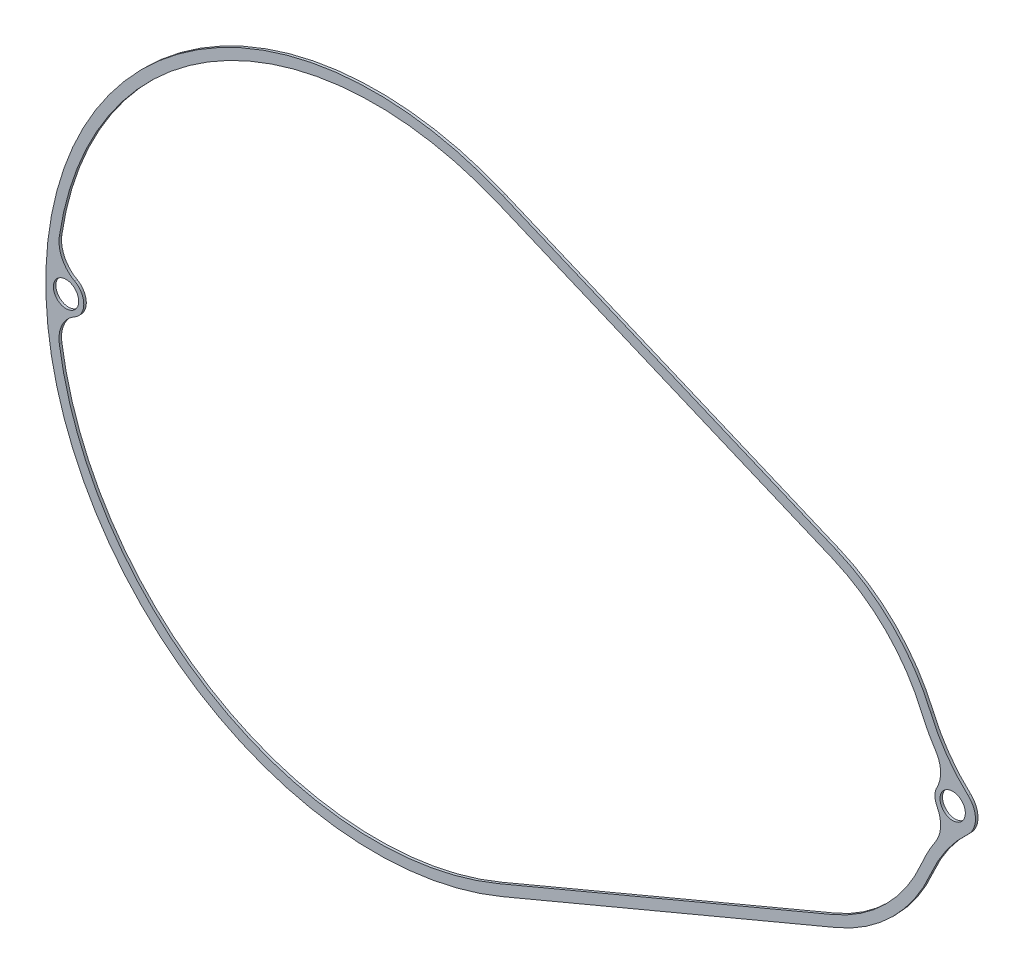
ISO-10303-21;
HEADER;
FILE_DESCRIPTION(('STEP AP214'),'2;1');
FILE_NAME('part.step','',(''),(''),'','','');
FILE_SCHEMA(('AUTOMOTIVE_DESIGN { 1 0 10303 214 1 1 1 1 }'));
ENDSEC;
DATA;
#1=APPLICATION_CONTEXT('core data for automotive mechanical design processes');
#2=APPLICATION_PROTOCOL_DEFINITION('international standard','automotive_design',2000,#1);
#3=PRODUCT_CONTEXT('',#1,'mechanical');
#4=PRODUCT('Part','Part','',(#3));
#5=PRODUCT_RELATED_PRODUCT_CATEGORY('part','',(#4));
#6=PRODUCT_DEFINITION_FORMATION('','',#4);
#7=PRODUCT_DEFINITION_CONTEXT('part definition',#1,'design');
#8=PRODUCT_DEFINITION('design','',#6,#7);
#9=PRODUCT_DEFINITION_SHAPE('','',#8);
#10=(LENGTH_UNIT() NAMED_UNIT(*) SI_UNIT(.MILLI.,.METRE.));
#11=(NAMED_UNIT(*) PLANE_ANGLE_UNIT() SI_UNIT($,.RADIAN.));
#12=(NAMED_UNIT(*) SI_UNIT($,.STERADIAN.) SOLID_ANGLE_UNIT());
#13=UNCERTAINTY_MEASURE_WITH_UNIT(LENGTH_MEASURE(1.E-05),#10,'distance_accuracy_value','');
#14=(GEOMETRIC_REPRESENTATION_CONTEXT(3) GLOBAL_UNCERTAINTY_ASSIGNED_CONTEXT((#13)) GLOBAL_UNIT_ASSIGNED_CONTEXT((#10,
#11,#12)) REPRESENTATION_CONTEXT('',''));
#15=CARTESIAN_POINT('',(0.,0.,0.));
#16=DIRECTION('',(0.,0.,1.));
#17=DIRECTION('',(1.,0.,0.));
#18=AXIS2_PLACEMENT_3D('',#15,#16,#17);
#19=CARTESIAN_POINT('',(-250.52892790721,0.,0.5));
#20=DIRECTION('',(0.,0.,-1.));
#21=DIRECTION('',(-1.,0.,0.));
#22=AXIS2_PLACEMENT_3D('',#19,#20,#21);
#23=CYLINDRICAL_SURFACE('',#22,63.);
#24=CARTESIAN_POINT('',(-250.52892790721,0.,0.5));
#25=DIRECTION('',(0.,0.,1.));
#26=DIRECTION('',(1.,0.,0.));
#27=AXIS2_PLACEMENT_3D('',#24,#25,#26);
#28=CIRCLE('',#27,63.);
#29=CARTESIAN_POINT('',(-226.141831133016,58.088462803952,0.5));
#30=VERTEX_POINT('',#29);
#31=CARTESIAN_POINT('',(-312.856257501688,9.18172018857619,0.5));
#32=VERTEX_POINT('',#31);
#33=EDGE_CURVE('E190',#30,#32,#28,.T.);
#34=ORIENTED_EDGE('',*,*,#33,.T.);
#35=DIRECTION('',(0.,0.,-1.));
#36=VECTOR('',#35,1.);
#37=CARTESIAN_POINT('',(-312.856257501688,9.18172018857619,0.5));
#38=LINE('',#37,#36);
#39=CARTESIAN_POINT('',(-312.856257501688,9.18172018857619,0.));
#40=VERTEX_POINT('',#39);
#41=EDGE_CURVE('E303',#32,#40,#38,.T.);
#42=ORIENTED_EDGE('',*,*,#41,.T.);
#43=CARTESIAN_POINT('',(-250.52892790721,0.,0.));
#44=DIRECTION('',(0.,0.,1.));
#45=DIRECTION('',(1.,0.,0.));
#46=AXIS2_PLACEMENT_3D('',#43,#44,#45);
#47=CIRCLE('',#46,63.);
#48=CARTESIAN_POINT('',(-226.141831133016,58.088462803952,0.));
#49=VERTEX_POINT('',#48);
#50=EDGE_CURVE('E213',#49,#40,#47,.T.);
#51=ORIENTED_EDGE('',*,*,#50,.F.);
#52=DIRECTION('',(0.,0.,-1.));
#53=VECTOR('',#52,1.);
#54=CARTESIAN_POINT('',(-226.141831133016,58.088462803952,0.5));
#55=LINE('',#54,#53);
#56=EDGE_CURVE('E183',#30,#49,#55,.T.);
#57=ORIENTED_EDGE('',*,*,#56,.F.);
#58=EDGE_LOOP('',(#34,#42,#51,#57));
#59=FACE_BOUND('',#58,.T.);
#60=ADVANCED_FACE('F16',(#59),#23,.F.);
#61=CARTESIAN_POINT('',(-113.207010098991,-25.423181345903,0.5));
#62=DIRECTION('',(0.,0.,1.));
#63=DIRECTION('',(1.,0.,0.));
#64=AXIS2_PLACEMENT_3D('',#61,#62,#63);
#65=PLANE('',#64);
#66=CARTESIAN_POINT('',(-311.52892790721,0.,0.5));
#67=DIRECTION('',(0.,0.,-1.));
#68=DIRECTION('',(-1.,0.,0.));
#69=AXIS2_PLACEMENT_3D('',#66,#67,#68);
#70=CIRCLE('',#69,2.5);
#71=CARTESIAN_POINT('',(-314.02892790721,0.,0.5));
#72=VERTEX_POINT('',#71);
#73=EDGE_CURVE('E372',#72,#72,#70,.T.);
#74=ORIENTED_EDGE('',*,*,#73,.T.);
#75=EDGE_LOOP('',(#74));
#76=FACE_BOUND('',#75,.T.);
#77=CARTESIAN_POINT('',(-312.856257501688,-9.18172018857617,0.5));
#78=VERTEX_POINT('',#77);
#79=CARTESIAN_POINT('',(-226.141831133016,-58.088462803952,0.5));
#80=VERTEX_POINT('',#79);
#81=EDGE_CURVE('E191',#78,#80,#28,.T.);
#82=ORIENTED_EDGE('',*,*,#81,.F.);
#83=CARTESIAN_POINT('',(-306.920321349833,-8.30727064680702,0.5));
#84=DIRECTION('',(0.,0.,1.));
#85=DIRECTION('',(1.,0.,0.));
#86=AXIS2_PLACEMENT_3D('',#83,#84,#85);
#87=CIRCLE('',#86,6.);
#88=CARTESIAN_POINT('',(-309.831020228176,-3.06057339619207,0.5));
#89=VERTEX_POINT('',#88);
#90=EDGE_CURVE('E316',#78,#89,#87,.F.);
#91=ORIENTED_EDGE('',*,*,#90,.T.);
#92=CARTESIAN_POINT('',(-311.52892790721,0.,0.5));
#93=DIRECTION('',(0.,0.,1.));
#94=DIRECTION('',(1.,0.,0.));
#95=AXIS2_PLACEMENT_3D('',#92,#93,#94);
#96=CIRCLE('',#95,3.5);
#97=CARTESIAN_POINT('',(-309.831020228176,3.06057339619208,0.5));
#98=VERTEX_POINT('',#97);
#99=EDGE_CURVE('E365',#89,#98,#96,.T.);
#100=ORIENTED_EDGE('',*,*,#99,.T.);
#101=CARTESIAN_POINT('',(-306.920321349833,8.30727064680703,0.5));
#102=DIRECTION('',(0.,0.,1.));
#103=DIRECTION('',(1.,0.,0.));
#104=AXIS2_PLACEMENT_3D('',#101,#102,#103);
#105=CIRCLE('',#104,6.);
#106=EDGE_CURVE('E318',#98,#32,#105,.F.);
#107=ORIENTED_EDGE('',*,*,#106,.T.);
#108=ORIENTED_EDGE('',*,*,#33,.F.);
#109=DIRECTION('',(-0.922039092126222,0.38709677419355,0.));
#110=VECTOR('',#109,1.);
#111=CARTESIAN_POINT('',(-160.254734358823,30.4272900401653,0.5));
#112=LINE('',#111,#110);
#113=CARTESIAN_POINT('',(-160.254734358823,30.4272900401653,0.5));
#114=VERTEX_POINT('',#113);
#115=EDGE_CURVE('E174',#114,#30,#112,.T.);
#116=ORIENTED_EDGE('',*,*,#115,.F.);
#117=CARTESIAN_POINT('',(-173.02892790721,0.,0.5));
#118=DIRECTION('',(0.,0.,1.));
#119=DIRECTION('',(1.,0.,0.));
#120=AXIS2_PLACEMENT_3D('',#117,#118,#119);
#121=CIRCLE('',#120,33.);
#122=CARTESIAN_POINT('',(-142.657800404576,12.9071536063815,0.5));
#123=VERTEX_POINT('',#122);
#124=EDGE_CURVE('E164',#123,#114,#121,.T.);
#125=ORIENTED_EDGE('',*,*,#124,.F.);
#126=CARTESIAN_POINT('',(-113.207010098991,25.423181345903,0.5));
#127=DIRECTION('',(0.,0.,-1.));
#128=DIRECTION('',(1.,0.,0.));
#129=AXIS2_PLACEMENT_3D('',#126,#127,#128);
#130=CIRCLE('',#129,32.);
#131=CARTESIAN_POINT('',(-139.904323330411,7.78080434552561,0.5));
#132=VERTEX_POINT('',#131);
#133=EDGE_CURVE('E206',#132,#123,#130,.T.);
#134=ORIENTED_EDGE('',*,*,#133,.F.);
#135=CARTESIAN_POINT('',(-144.910069561303,4.47285865795486,0.5));
#136=DIRECTION('',(0.,0.,1.));
#137=DIRECTION('',(1.,0.,0.));
#138=AXIS2_PLACEMENT_3D('',#135,#136,#137);
#139=CIRCLE('',#138,6.);
#140=CARTESIAN_POINT('',(-139.616716937665,1.64789529503601,0.5));
#141=VERTEX_POINT('',#140);
#142=EDGE_CURVE('E11',#132,#141,#139,.F.);
#143=ORIENTED_EDGE('',*,*,#142,.T.);
#144=CARTESIAN_POINT('',(-136.52892790721,0.,0.5));
#145=DIRECTION('',(0.,0.,1.));
#146=DIRECTION('',(1.,0.,0.));
#147=AXIS2_PLACEMENT_3D('',#144,#145,#146);
#148=CIRCLE('',#147,3.5);
#149=CARTESIAN_POINT('',(-139.616716937665,-1.64789529503601,0.5));
#150=VERTEX_POINT('',#149);
#151=EDGE_CURVE('E338',#141,#150,#148,.T.);
#152=ORIENTED_EDGE('',*,*,#151,.T.);
#153=CARTESIAN_POINT('',(-144.910069561303,-4.47285865795487,0.5));
#154=DIRECTION('',(0.,0.,1.));
#155=DIRECTION('',(1.,0.,0.));
#156=AXIS2_PLACEMENT_3D('',#153,#154,#155);
#157=CIRCLE('',#156,6.);
#158=CARTESIAN_POINT('',(-139.904323330411,-7.78080434552562,0.5));
#159=VERTEX_POINT('',#158);
#160=EDGE_CURVE('E322',#150,#159,#157,.F.);
#161=ORIENTED_EDGE('',*,*,#160,.T.);
#162=CARTESIAN_POINT('',(-113.207010098991,-25.423181345903,0.5));
#163=DIRECTION('',(0.,0.,-1.));
#164=DIRECTION('',(1.,0.,0.));
#165=AXIS2_PLACEMENT_3D('',#162,#163,#164);
#166=CIRCLE('',#165,32.);
#167=CARTESIAN_POINT('',(-142.657800404576,-12.9071536063815,0.5));
#168=VERTEX_POINT('',#167);
#169=EDGE_CURVE('E200',#168,#159,#166,.T.);
#170=ORIENTED_EDGE('',*,*,#169,.F.);
#171=CARTESIAN_POINT('',(-173.02892790721,0.,0.5));
#172=DIRECTION('',(0.,0.,1.));
#173=DIRECTION('',(1.,0.,0.));
#174=AXIS2_PLACEMENT_3D('',#171,#172,#173);
#175=CIRCLE('',#174,33.);
#176=CARTESIAN_POINT('',(-160.254734358823,-30.4272900401653,0.5));
#177=VERTEX_POINT('',#176);
#178=EDGE_CURVE('E198',#177,#168,#175,.T.);
#179=ORIENTED_EDGE('',*,*,#178,.F.);
#180=DIRECTION('',(0.922039092126222,0.38709677419355,0.));
#181=VECTOR('',#180,1.);
#182=CARTESIAN_POINT('',(-226.141831133016,-58.088462803952,0.5));
#183=LINE('',#182,#181);
#184=EDGE_CURVE('E196',#80,#177,#183,.T.);
#185=ORIENTED_EDGE('',*,*,#184,.F.);
#186=EDGE_LOOP('',(#82,#91,#100,#107,#108,#116,#125,#134,#143,#152,#161,#170,#179,#185));
#187=FACE_BOUND('',#186,.T.);
#188=CARTESIAN_POINT('',(-113.207010098991,-25.423181345903,0.5));
#189=DIRECTION('',(0.,0.,-1.));
#190=DIRECTION('',(1.,0.,0.));
#191=AXIS2_PLACEMENT_3D('',#188,#189,#190);
#192=CIRCLE('',#191,30.);
#193=CARTESIAN_POINT('',(-140.817126010477,-13.6894053401016,0.5));
#194=VERTEX_POINT('',#193);
#195=CARTESIAN_POINT('',(-133.486938627878,-3.31606713207429,0.5));
#196=VERTEX_POINT('',#195);
#197=EDGE_CURVE('E238',#194,#196,#192,.T.);
#198=ORIENTED_EDGE('',*,*,#197,.T.);
#199=CARTESIAN_POINT('',(-136.52892790721,0.,0.5));
#200=DIRECTION('',(0.,0.,1.));
#201=DIRECTION('',(1.,0.,0.));
#202=AXIS2_PLACEMENT_3D('',#199,#200,#201);
#203=CIRCLE('',#202,4.5);
#204=CARTESIAN_POINT('',(-133.486938627878,3.31606713207429,0.5));
#205=VERTEX_POINT('',#204);
#206=EDGE_CURVE('E241',#196,#205,#203,.T.);
#207=ORIENTED_EDGE('',*,*,#206,.T.);
#208=CARTESIAN_POINT('',(-113.207010098991,25.423181345903,0.5));
#209=DIRECTION('',(0.,0.,-1.));
#210=DIRECTION('',(1.,0.,0.));
#211=AXIS2_PLACEMENT_3D('',#208,#209,#210);
#212=CIRCLE('',#211,30.);
#213=CARTESIAN_POINT('',(-140.817126010477,13.6894053401016,0.5));
#214=VERTEX_POINT('',#213);
#215=EDGE_CURVE('E244',#205,#214,#212,.T.);
#216=ORIENTED_EDGE('',*,*,#215,.T.);
#217=CARTESIAN_POINT('',(-173.02892790721,0.,0.5));
#218=DIRECTION('',(0.,0.,1.));
#219=DIRECTION('',(1.,0.,0.));
#220=AXIS2_PLACEMENT_3D('',#217,#218,#219);
#221=CIRCLE('',#220,35.);
#222=CARTESIAN_POINT('',(-159.480540810437,32.2713682244178,0.5));
#223=VERTEX_POINT('',#222);
#224=EDGE_CURVE('E246',#214,#223,#221,.T.);
#225=ORIENTED_EDGE('',*,*,#224,.T.);
#226=DIRECTION('',(-0.922039092126222,0.38709677419355,0.));
#227=VECTOR('',#226,1.);
#228=CARTESIAN_POINT('',(-159.480540810437,32.2713682244178,0.5));
#229=LINE('',#228,#227);
#230=CARTESIAN_POINT('',(-225.36763758463,59.9325409882045,0.5));
#231=VERTEX_POINT('',#230);
#232=EDGE_CURVE('E248',#223,#231,#229,.T.);
#233=ORIENTED_EDGE('',*,*,#232,.T.);
#234=CARTESIAN_POINT('',(-250.52892790721,0.,0.5));
#235=DIRECTION('',(0.,0.,1.));
#236=DIRECTION('',(1.,0.,0.));
#237=AXIS2_PLACEMENT_3D('',#234,#235,#236);
#238=CIRCLE('',#237,65.);
#239=CARTESIAN_POINT('',(-225.36763758463,-59.9325409882045,0.5));
#240=VERTEX_POINT('',#239);
#241=EDGE_CURVE('E250',#231,#240,#238,.T.);
#242=ORIENTED_EDGE('',*,*,#241,.T.);
#243=DIRECTION('',(0.922039092126222,0.38709677419355,0.));
#244=VECTOR('',#243,1.);
#245=CARTESIAN_POINT('',(-225.36763758463,-59.9325409882045,0.5));
#246=LINE('',#245,#244);
#247=CARTESIAN_POINT('',(-159.480540810437,-32.2713682244178,0.5));
#248=VERTEX_POINT('',#247);
#249=EDGE_CURVE('E252',#240,#248,#246,.T.);
#250=ORIENTED_EDGE('',*,*,#249,.T.);
#251=CARTESIAN_POINT('',(-173.02892790721,0.,0.5));
#252=DIRECTION('',(0.,0.,1.));
#253=DIRECTION('',(1.,0.,0.));
#254=AXIS2_PLACEMENT_3D('',#251,#252,#253);
#255=CIRCLE('',#254,35.);
#256=EDGE_CURVE('E254',#248,#194,#255,.T.);
#257=ORIENTED_EDGE('',*,*,#256,.T.);
#258=EDGE_LOOP('',(#198,#207,#216,#225,#233,#242,#250,#257));
#259=FACE_BOUND('',#258,.T.);
#260=CARTESIAN_POINT('',(-136.52892790721,0.,0.5));
#261=DIRECTION('',(0.,0.,1.));
#262=DIRECTION('',(1.,0.,0.));
#263=AXIS2_PLACEMENT_3D('',#260,#261,#262);
#264=CIRCLE('',#263,2.5);
#265=CARTESIAN_POINT('',(-134.02892790721,0.,0.5));
#266=VERTEX_POINT('',#265);
#267=EDGE_CURVE('E203',#266,#266,#264,.T.);
#268=ORIENTED_EDGE('',*,*,#267,.F.);
#269=EDGE_LOOP('',(#268));
#270=FACE_BOUND('',#269,.T.);
#271=ADVANCED_FACE('F187',(#76,#187,#259,#270),#65,.T.);
#272=CARTESIAN_POINT('',(-113.207010098991,-25.423181345903,0.));
#273=DIRECTION('',(0.,0.,1.));
#274=DIRECTION('',(1.,0.,0.));
#275=AXIS2_PLACEMENT_3D('',#272,#273,#274);
#276=PLANE('',#275);
#277=CARTESIAN_POINT('',(-311.52892790721,0.,0.));
#278=DIRECTION('',(0.,0.,-1.));
#279=DIRECTION('',(-1.,0.,0.));
#280=AXIS2_PLACEMENT_3D('',#277,#278,#279);
#281=CIRCLE('',#280,2.5);
#282=CARTESIAN_POINT('',(-314.02892790721,0.,0.));
#283=VERTEX_POINT('',#282);
#284=EDGE_CURVE('E376',#283,#283,#281,.T.);
#285=ORIENTED_EDGE('',*,*,#284,.F.);
#286=EDGE_LOOP('',(#285));
#287=FACE_BOUND('',#286,.T.);
#288=CARTESIAN_POINT('',(-113.207010098991,-25.423181345903,0.));
#289=DIRECTION('',(0.,0.,-1.));
#290=DIRECTION('',(1.,0.,0.));
#291=AXIS2_PLACEMENT_3D('',#288,#289,#290);
#292=CIRCLE('',#291,30.);
#293=CARTESIAN_POINT('',(-140.817126010477,-13.6894053401016,0.));
#294=VERTEX_POINT('',#293);
#295=CARTESIAN_POINT('',(-133.486938627878,-3.31606713207429,0.));
#296=VERTEX_POINT('',#295);
#297=EDGE_CURVE('E182',#294,#296,#292,.T.);
#298=ORIENTED_EDGE('',*,*,#297,.F.);
#299=CARTESIAN_POINT('',(-173.02892790721,0.,0.));
#300=DIRECTION('',(0.,0.,1.));
#301=DIRECTION('',(1.,0.,0.));
#302=AXIS2_PLACEMENT_3D('',#299,#300,#301);
#303=CIRCLE('',#302,35.);
#304=CARTESIAN_POINT('',(-159.480540810437,-32.2713682244178,0.));
#305=VERTEX_POINT('',#304);
#306=EDGE_CURVE('E242',#305,#294,#303,.T.);
#307=ORIENTED_EDGE('',*,*,#306,.F.);
#308=DIRECTION('',(0.922039092126222,0.38709677419355,0.));
#309=VECTOR('',#308,1.);
#310=CARTESIAN_POINT('',(-225.36763758463,-59.9325409882045,0.));
#311=LINE('',#310,#309);
#312=CARTESIAN_POINT('',(-225.36763758463,-59.9325409882045,0.));
#313=VERTEX_POINT('',#312);
#314=EDGE_CURVE('E269',#313,#305,#311,.T.);
#315=ORIENTED_EDGE('',*,*,#314,.F.);
#316=CARTESIAN_POINT('',(-250.52892790721,0.,0.));
#317=DIRECTION('',(0.,0.,1.));
#318=DIRECTION('',(1.,0.,0.));
#319=AXIS2_PLACEMENT_3D('',#316,#317,#318);
#320=CIRCLE('',#319,65.);
#321=CARTESIAN_POINT('',(-225.36763758463,59.9325409882045,0.));
#322=VERTEX_POINT('',#321);
#323=EDGE_CURVE('E267',#322,#313,#320,.T.);
#324=ORIENTED_EDGE('',*,*,#323,.F.);
#325=DIRECTION('',(-0.922039092126222,0.38709677419355,0.));
#326=VECTOR('',#325,1.);
#327=CARTESIAN_POINT('',(-159.480540810437,32.2713682244178,0.));
#328=LINE('',#327,#326);
#329=CARTESIAN_POINT('',(-159.480540810437,32.2713682244178,0.));
#330=VERTEX_POINT('',#329);
#331=EDGE_CURVE('E265',#330,#322,#328,.T.);
#332=ORIENTED_EDGE('',*,*,#331,.F.);
#333=CARTESIAN_POINT('',(-173.02892790721,0.,0.));
#334=DIRECTION('',(0.,0.,1.));
#335=DIRECTION('',(1.,0.,0.));
#336=AXIS2_PLACEMENT_3D('',#333,#334,#335);
#337=CIRCLE('',#336,35.);
#338=CARTESIAN_POINT('',(-140.817126010477,13.6894053401016,0.));
#339=VERTEX_POINT('',#338);
#340=EDGE_CURVE('E263',#339,#330,#337,.T.);
#341=ORIENTED_EDGE('',*,*,#340,.F.);
#342=CARTESIAN_POINT('',(-113.207010098991,25.423181345903,0.));
#343=DIRECTION('',(0.,0.,-1.));
#344=DIRECTION('',(1.,0.,0.));
#345=AXIS2_PLACEMENT_3D('',#342,#343,#344);
#346=CIRCLE('',#345,30.);
#347=CARTESIAN_POINT('',(-133.486938627878,3.31606713207429,0.));
#348=VERTEX_POINT('',#347);
#349=EDGE_CURVE('E261',#348,#339,#346,.T.);
#350=ORIENTED_EDGE('',*,*,#349,.F.);
#351=CARTESIAN_POINT('',(-136.52892790721,0.,0.));
#352=DIRECTION('',(0.,0.,1.));
#353=DIRECTION('',(1.,0.,0.));
#354=AXIS2_PLACEMENT_3D('',#351,#352,#353);
#355=CIRCLE('',#354,4.5);
#356=EDGE_CURVE('E259',#296,#348,#355,.T.);
#357=ORIENTED_EDGE('',*,*,#356,.F.);
#358=EDGE_LOOP('',(#298,#307,#315,#324,#332,#341,#350,#357));
#359=FACE_BOUND('',#358,.T.);
#360=ORIENTED_EDGE('',*,*,#50,.T.);
#361=CARTESIAN_POINT('',(-306.920321349833,8.30727064680703,0.));
#362=DIRECTION('',(0.,0.,1.));
#363=DIRECTION('',(1.,0.,0.));
#364=AXIS2_PLACEMENT_3D('',#361,#362,#363);
#365=CIRCLE('',#364,6.);
#366=CARTESIAN_POINT('',(-309.831020228176,3.06057339619208,0.));
#367=VERTEX_POINT('',#366);
#368=EDGE_CURVE('E320',#40,#367,#365,.T.);
#369=ORIENTED_EDGE('',*,*,#368,.T.);
#370=CARTESIAN_POINT('',(-311.52892790721,0.,0.));
#371=DIRECTION('',(0.,0.,1.));
#372=DIRECTION('',(1.,0.,0.));
#373=AXIS2_PLACEMENT_3D('',#370,#371,#372);
#374=CIRCLE('',#373,3.5);
#375=CARTESIAN_POINT('',(-309.831020228176,-3.06057339619207,0.));
#376=VERTEX_POINT('',#375);
#377=EDGE_CURVE('E371',#367,#376,#374,.F.);
#378=ORIENTED_EDGE('',*,*,#377,.T.);
#379=CARTESIAN_POINT('',(-306.920321349833,-8.30727064680702,0.));
#380=DIRECTION('',(0.,0.,1.));
#381=DIRECTION('',(1.,0.,0.));
#382=AXIS2_PLACEMENT_3D('',#379,#380,#381);
#383=CIRCLE('',#382,6.);
#384=CARTESIAN_POINT('',(-312.856257501688,-9.18172018857617,0.));
#385=VERTEX_POINT('',#384);
#386=EDGE_CURVE('E314',#376,#385,#383,.T.);
#387=ORIENTED_EDGE('',*,*,#386,.T.);
#388=CARTESIAN_POINT('',(-226.141831133016,-58.088462803952,0.));
#389=VERTEX_POINT('',#388);
#390=EDGE_CURVE('E212',#385,#389,#47,.T.);
#391=ORIENTED_EDGE('',*,*,#390,.T.);
#392=DIRECTION('',(0.922039092126222,0.38709677419355,0.));
#393=VECTOR('',#392,1.);
#394=CARTESIAN_POINT('',(-226.141831133016,-58.088462803952,0.));
#395=LINE('',#394,#393);
#396=CARTESIAN_POINT('',(-160.254734358823,-30.4272900401653,0.));
#397=VERTEX_POINT('',#396);
#398=EDGE_CURVE('E216',#389,#397,#395,.T.);
#399=ORIENTED_EDGE('',*,*,#398,.T.);
#400=CARTESIAN_POINT('',(-173.02892790721,0.,0.));
#401=DIRECTION('',(0.,0.,1.));
#402=DIRECTION('',(1.,0.,0.));
#403=AXIS2_PLACEMENT_3D('',#400,#401,#402);
#404=CIRCLE('',#403,33.);
#405=CARTESIAN_POINT('',(-142.657800404576,-12.9071536063815,0.));
#406=VERTEX_POINT('',#405);
#407=EDGE_CURVE('E219',#397,#406,#404,.T.);
#408=ORIENTED_EDGE('',*,*,#407,.T.);
#409=CARTESIAN_POINT('',(-113.207010098991,-25.423181345903,0.));
#410=DIRECTION('',(0.,0.,-1.));
#411=DIRECTION('',(1.,0.,0.));
#412=AXIS2_PLACEMENT_3D('',#409,#410,#411);
#413=CIRCLE('',#412,32.);
#414=CARTESIAN_POINT('',(-139.904323330411,-7.78080434552562,0.));
#415=VERTEX_POINT('',#414);
#416=EDGE_CURVE('E222',#406,#415,#413,.T.);
#417=ORIENTED_EDGE('',*,*,#416,.T.);
#418=CARTESIAN_POINT('',(-144.910069561303,-4.47285865795487,0.));
#419=DIRECTION('',(0.,0.,1.));
#420=DIRECTION('',(1.,0.,0.));
#421=AXIS2_PLACEMENT_3D('',#418,#419,#420);
#422=CIRCLE('',#421,6.);
#423=CARTESIAN_POINT('',(-139.616716937665,-1.64789529503601,0.));
#424=VERTEX_POINT('',#423);
#425=EDGE_CURVE('E324',#415,#424,#422,.T.);
#426=ORIENTED_EDGE('',*,*,#425,.T.);
#427=CARTESIAN_POINT('',(-136.52892790721,0.,0.));
#428=DIRECTION('',(0.,0.,1.));
#429=DIRECTION('',(1.,0.,0.));
#430=AXIS2_PLACEMENT_3D('',#427,#428,#429);
#431=CIRCLE('',#430,3.5);
#432=CARTESIAN_POINT('',(-139.616716937665,1.64789529503601,0.));
#433=VERTEX_POINT('',#432);
#434=EDGE_CURVE('E210',#424,#433,#431,.F.);
#435=ORIENTED_EDGE('',*,*,#434,.T.);
#436=CARTESIAN_POINT('',(-144.910069561303,4.47285865795486,0.));
#437=DIRECTION('',(0.,0.,1.));
#438=DIRECTION('',(1.,0.,0.));
#439=AXIS2_PLACEMENT_3D('',#436,#437,#438);
#440=CIRCLE('',#439,6.);
#441=CARTESIAN_POINT('',(-139.904323330411,7.78080434552561,0.));
#442=VERTEX_POINT('',#441);
#443=EDGE_CURVE('E24',#433,#442,#440,.T.);
#444=ORIENTED_EDGE('',*,*,#443,.T.);
#445=CARTESIAN_POINT('',(-113.207010098991,25.423181345903,0.));
#446=DIRECTION('',(0.,0.,-1.));
#447=DIRECTION('',(1.,0.,0.));
#448=AXIS2_PLACEMENT_3D('',#445,#446,#447);
#449=CIRCLE('',#448,32.);
#450=CARTESIAN_POINT('',(-142.657800404576,12.9071536063815,0.));
#451=VERTEX_POINT('',#450);
#452=EDGE_CURVE('E175',#442,#451,#449,.T.);
#453=ORIENTED_EDGE('',*,*,#452,.T.);
#454=CARTESIAN_POINT('',(-173.02892790721,0.,0.));
#455=DIRECTION('',(0.,0.,1.));
#456=DIRECTION('',(1.,0.,0.));
#457=AXIS2_PLACEMENT_3D('',#454,#455,#456);
#458=CIRCLE('',#457,33.);
#459=CARTESIAN_POINT('',(-160.254734358823,30.4272900401653,0.));
#460=VERTEX_POINT('',#459);
#461=EDGE_CURVE('E208',#451,#460,#458,.T.);
#462=ORIENTED_EDGE('',*,*,#461,.T.);
#463=DIRECTION('',(-0.922039092126222,0.38709677419355,0.));
#464=VECTOR('',#463,1.);
#465=CARTESIAN_POINT('',(-160.254734358823,30.4272900401653,0.));
#466=LINE('',#465,#464);
#467=EDGE_CURVE('E181',#460,#49,#466,.T.);
#468=ORIENTED_EDGE('',*,*,#467,.T.);
#469=EDGE_LOOP('',(#360,#369,#378,#387,#391,#399,#408,#417,#426,#435,#444,#453,#462,#468));
#470=FACE_BOUND('',#469,.T.);
#471=CARTESIAN_POINT('',(-136.52892790721,0.,0.));
#472=DIRECTION('',(0.,0.,1.));
#473=DIRECTION('',(1.,0.,0.));
#474=AXIS2_PLACEMENT_3D('',#471,#472,#473);
#475=CIRCLE('',#474,2.5);
#476=CARTESIAN_POINT('',(-134.02892790721,0.,0.));
#477=VERTEX_POINT('',#476);
#478=EDGE_CURVE('E225',#477,#477,#475,.T.);
#479=ORIENTED_EDGE('',*,*,#478,.T.);
#480=EDGE_LOOP('',(#479));
#481=FACE_BOUND('',#480,.T.);
#482=ADVANCED_FACE('F327',(#287,#359,#470,#481),#276,.F.);
#483=CARTESIAN_POINT('',(-113.207010098991,-25.423181345903,0.5));
#484=DIRECTION('',(0.,0.,-1.));
#485=DIRECTION('',(-1.,0.,0.));
#486=AXIS2_PLACEMENT_3D('',#483,#484,#485);
#487=CYLINDRICAL_SURFACE('',#486,30.);
#488=ORIENTED_EDGE('',*,*,#297,.T.);
#489=DIRECTION('',(0.,0.,-1.));
#490=VECTOR('',#489,1.);
#491=CARTESIAN_POINT('',(-133.486938627878,-3.31606713207429,0.5));
#492=LINE('',#491,#490);
#493=EDGE_CURVE('E292',#196,#296,#492,.T.);
#494=ORIENTED_EDGE('',*,*,#493,.F.);
#495=ORIENTED_EDGE('',*,*,#197,.F.);
#496=DIRECTION('',(0.,0.,-1.));
#497=VECTOR('',#496,1.);
#498=CARTESIAN_POINT('',(-140.817126010477,-13.6894053401016,0.5));
#499=LINE('',#498,#497);
#500=EDGE_CURVE('E256',#194,#294,#499,.T.);
#501=ORIENTED_EDGE('',*,*,#500,.T.);
#502=EDGE_LOOP('',(#488,#494,#495,#501));
#503=FACE_BOUND('',#502,.T.);
#504=ADVANCED_FACE('F386',(#503),#487,.F.);
#505=CARTESIAN_POINT('',(-136.52892790721,0.,0.5));
#506=DIRECTION('',(0.,0.,-1.));
#507=DIRECTION('',(-1.,0.,0.));
#508=AXIS2_PLACEMENT_3D('',#505,#506,#507);
#509=CYLINDRICAL_SURFACE('',#508,4.5);
#510=ORIENTED_EDGE('',*,*,#356,.T.);
#511=DIRECTION('',(0.,0.,-1.));
#512=VECTOR('',#511,1.);
#513=CARTESIAN_POINT('',(-133.486938627878,3.31606713207429,0.5));
#514=LINE('',#513,#512);
#515=EDGE_CURVE('E289',#205,#348,#514,.T.);
#516=ORIENTED_EDGE('',*,*,#515,.F.);
#517=ORIENTED_EDGE('',*,*,#206,.F.);
#518=ORIENTED_EDGE('',*,*,#493,.T.);
#519=EDGE_LOOP('',(#510,#516,#517,#518));
#520=FACE_BOUND('',#519,.T.);
#521=ADVANCED_FACE('F424',(#520),#509,.T.);
#522=CARTESIAN_POINT('',(-113.207010098991,25.423181345903,0.5));
#523=DIRECTION('',(0.,0.,-1.));
#524=DIRECTION('',(-1.,0.,0.));
#525=AXIS2_PLACEMENT_3D('',#522,#523,#524);
#526=CYLINDRICAL_SURFACE('',#525,30.);
#527=ORIENTED_EDGE('',*,*,#349,.T.);
#528=DIRECTION('',(0.,0.,-1.));
#529=VECTOR('',#528,1.);
#530=CARTESIAN_POINT('',(-140.817126010477,13.6894053401016,0.5));
#531=LINE('',#530,#529);
#532=EDGE_CURVE('E286',#214,#339,#531,.T.);
#533=ORIENTED_EDGE('',*,*,#532,.F.);
#534=ORIENTED_EDGE('',*,*,#215,.F.);
#535=ORIENTED_EDGE('',*,*,#515,.T.);
#536=EDGE_LOOP('',(#527,#533,#534,#535));
#537=FACE_BOUND('',#536,.T.);
#538=ADVANCED_FACE('F420',(#537),#526,.F.);
#539=CARTESIAN_POINT('',(-173.02892790721,0.,0.5));
#540=DIRECTION('',(0.,0.,-1.));
#541=DIRECTION('',(-1.,0.,0.));
#542=AXIS2_PLACEMENT_3D('',#539,#540,#541);
#543=CYLINDRICAL_SURFACE('',#542,35.);
#544=ORIENTED_EDGE('',*,*,#340,.T.);
#545=DIRECTION('',(0.,0.,-1.));
#546=VECTOR('',#545,1.);
#547=CARTESIAN_POINT('',(-159.480540810437,32.2713682244178,0.5));
#548=LINE('',#547,#546);
#549=EDGE_CURVE('E283',#223,#330,#548,.T.);
#550=ORIENTED_EDGE('',*,*,#549,.F.);
#551=ORIENTED_EDGE('',*,*,#224,.F.);
#552=ORIENTED_EDGE('',*,*,#532,.T.);
#553=EDGE_LOOP('',(#544,#550,#551,#552));
#554=FACE_BOUND('',#553,.T.);
#555=ADVANCED_FACE('F417',(#554),#543,.T.);
#556=CARTESIAN_POINT('',(-159.480540810437,32.2713682244178,0.5));
#557=DIRECTION('',(-0.38709677419355,-0.922039092126222,0.));
#558=DIRECTION('',(0.922039092126222,-0.38709677419355,0.));
#559=AXIS2_PLACEMENT_3D('',#556,#557,#558);
#560=PLANE('',#559);
#561=ORIENTED_EDGE('',*,*,#331,.T.);
#562=DIRECTION('',(0.,0.,-1.));
#563=VECTOR('',#562,1.);
#564=CARTESIAN_POINT('',(-225.36763758463,59.9325409882045,0.5));
#565=LINE('',#564,#563);
#566=EDGE_CURVE('E280',#231,#322,#565,.T.);
#567=ORIENTED_EDGE('',*,*,#566,.F.);
#568=ORIENTED_EDGE('',*,*,#232,.F.);
#569=ORIENTED_EDGE('',*,*,#549,.T.);
#570=EDGE_LOOP('',(#561,#567,#568,#569));
#571=FACE_BOUND('',#570,.T.);
#572=ADVANCED_FACE('F413',(#571),#560,.F.);
#573=CARTESIAN_POINT('',(-250.52892790721,0.,0.5));
#574=DIRECTION('',(0.,0.,-1.));
#575=DIRECTION('',(-1.,0.,0.));
#576=AXIS2_PLACEMENT_3D('',#573,#574,#575);
#577=CYLINDRICAL_SURFACE('',#576,65.);
#578=ORIENTED_EDGE('',*,*,#323,.T.);
#579=DIRECTION('',(0.,0.,-1.));
#580=VECTOR('',#579,1.);
#581=CARTESIAN_POINT('',(-225.36763758463,-59.9325409882045,0.5));
#582=LINE('',#581,#580);
#583=EDGE_CURVE('E277',#240,#313,#582,.T.);
#584=ORIENTED_EDGE('',*,*,#583,.F.);
#585=ORIENTED_EDGE('',*,*,#241,.F.);
#586=ORIENTED_EDGE('',*,*,#566,.T.);
#587=EDGE_LOOP('',(#578,#584,#585,#586));
#588=FACE_BOUND('',#587,.T.);
#589=ADVANCED_FACE('F408',(#588),#577,.T.);
#590=CARTESIAN_POINT('',(-225.36763758463,-59.9325409882045,0.5));
#591=DIRECTION('',(-0.38709677419355,0.922039092126222,0.));
#592=DIRECTION('',(-0.922039092126222,-0.38709677419355,0.));
#593=AXIS2_PLACEMENT_3D('',#590,#591,#592);
#594=PLANE('',#593);
#595=ORIENTED_EDGE('',*,*,#314,.T.);
#596=DIRECTION('',(0.,0.,-1.));
#597=VECTOR('',#596,1.);
#598=CARTESIAN_POINT('',(-159.480540810437,-32.2713682244178,0.5));
#599=LINE('',#598,#597);
#600=EDGE_CURVE('E274',#248,#305,#599,.T.);
#601=ORIENTED_EDGE('',*,*,#600,.F.);
#602=ORIENTED_EDGE('',*,*,#249,.F.);
#603=ORIENTED_EDGE('',*,*,#583,.T.);
#604=EDGE_LOOP('',(#595,#601,#602,#603));
#605=FACE_BOUND('',#604,.T.);
#606=ADVANCED_FACE('F402',(#605),#594,.F.);
#607=CARTESIAN_POINT('',(-173.02892790721,0.,0.5));
#608=DIRECTION('',(0.,0.,-1.));
#609=DIRECTION('',(-1.,0.,0.));
#610=AXIS2_PLACEMENT_3D('',#607,#608,#609);
#611=CYLINDRICAL_SURFACE('',#610,35.);
#612=ORIENTED_EDGE('',*,*,#306,.T.);
#613=ORIENTED_EDGE('',*,*,#500,.F.);
#614=ORIENTED_EDGE('',*,*,#256,.F.);
#615=ORIENTED_EDGE('',*,*,#600,.T.);
#616=EDGE_LOOP('',(#612,#613,#614,#615));
#617=FACE_BOUND('',#616,.T.);
#618=ADVANCED_FACE('F398',(#617),#611,.T.);
#619=CARTESIAN_POINT('',(-173.02892790721,0.,0.5));
#620=DIRECTION('',(0.,0.,-1.));
#621=DIRECTION('',(-1.,0.,0.));
#622=AXIS2_PLACEMENT_3D('',#619,#620,#621);
#623=CYLINDRICAL_SURFACE('',#622,33.);
#624=ORIENTED_EDGE('',*,*,#461,.F.);
#625=DIRECTION('',(0.,0.,-1.));
#626=VECTOR('',#625,1.);
#627=CARTESIAN_POINT('',(-142.657800404576,12.9071536063815,0.5));
#628=LINE('',#627,#626);
#629=EDGE_CURVE('E171',#123,#451,#628,.T.);
#630=ORIENTED_EDGE('',*,*,#629,.F.);
#631=ORIENTED_EDGE('',*,*,#124,.T.);
#632=DIRECTION('',(0.,0.,-1.));
#633=VECTOR('',#632,1.);
#634=CARTESIAN_POINT('',(-160.254734358823,30.4272900401653,0.5));
#635=LINE('',#634,#633);
#636=EDGE_CURVE('E168',#114,#460,#635,.T.);
#637=ORIENTED_EDGE('',*,*,#636,.T.);
#638=EDGE_LOOP('',(#624,#630,#631,#637));
#639=FACE_BOUND('',#638,.T.);
#640=ADVANCED_FACE('F167',(#639),#623,.F.);
#641=CARTESIAN_POINT('',(-160.254734358823,30.4272900401653,0.5));
#642=DIRECTION('',(-0.387096774193549,-0.922039092126222,0.));
#643=DIRECTION('',(0.922039092126222,-0.38709677419355,0.));
#644=AXIS2_PLACEMENT_3D('',#641,#642,#643);
#645=PLANE('',#644);
#646=ORIENTED_EDGE('',*,*,#467,.F.);
#647=ORIENTED_EDGE('',*,*,#636,.F.);
#648=ORIENTED_EDGE('',*,*,#115,.T.);
#649=ORIENTED_EDGE('',*,*,#56,.T.);
#650=EDGE_LOOP('',(#646,#647,#648,#649));
#651=FACE_BOUND('',#650,.T.);
#652=ADVANCED_FACE('F178',(#651),#645,.T.);
#653=ORIENTED_EDGE('',*,*,#390,.F.);
#654=DIRECTION('',(0.,0.,-1.));
#655=VECTOR('',#654,1.);
#656=CARTESIAN_POINT('',(-312.856257501688,-9.18172018857618,0.5));
#657=LINE('',#656,#655);
#658=EDGE_CURVE('E301',#385,#78,#657,.F.);
#659=ORIENTED_EDGE('',*,*,#658,.T.);
#660=ORIENTED_EDGE('',*,*,#81,.T.);
#661=DIRECTION('',(0.,0.,-1.));
#662=VECTOR('',#661,1.);
#663=CARTESIAN_POINT('',(-226.141831133016,-58.088462803952,0.5));
#664=LINE('',#663,#662);
#665=EDGE_CURVE('E234',#80,#389,#664,.T.);
#666=ORIENTED_EDGE('',*,*,#665,.T.);
#667=EDGE_LOOP('',(#653,#659,#660,#666));
#668=FACE_BOUND('',#667,.T.);
#669=ADVANCED_FACE('F358',(#668),#23,.F.);
#670=CARTESIAN_POINT('',(-226.141831133016,-58.088462803952,0.5));
#671=DIRECTION('',(-0.38709677419355,0.922039092126222,0.));
#672=DIRECTION('',(-0.922039092126222,-0.38709677419355,0.));
#673=AXIS2_PLACEMENT_3D('',#670,#671,#672);
#674=PLANE('',#673);
#675=ORIENTED_EDGE('',*,*,#398,.F.);
#676=ORIENTED_EDGE('',*,*,#665,.F.);
#677=ORIENTED_EDGE('',*,*,#184,.T.);
#678=DIRECTION('',(0.,0.,-1.));
#679=VECTOR('',#678,1.);
#680=CARTESIAN_POINT('',(-160.254734358823,-30.4272900401653,0.5));
#681=LINE('',#680,#679);
#682=EDGE_CURVE('E232',#177,#397,#681,.T.);
#683=ORIENTED_EDGE('',*,*,#682,.T.);
#684=EDGE_LOOP('',(#675,#676,#677,#683));
#685=FACE_BOUND('',#684,.T.);
#686=ADVANCED_FACE('F355',(#685),#674,.T.);
#687=CARTESIAN_POINT('',(-173.02892790721,0.,0.5));
#688=DIRECTION('',(0.,0.,-1.));
#689=DIRECTION('',(-1.,0.,0.));
#690=AXIS2_PLACEMENT_3D('',#687,#688,#689);
#691=CYLINDRICAL_SURFACE('',#690,33.);
#692=ORIENTED_EDGE('',*,*,#407,.F.);
#693=ORIENTED_EDGE('',*,*,#682,.F.);
#694=ORIENTED_EDGE('',*,*,#178,.T.);
#695=DIRECTION('',(0.,0.,-1.));
#696=VECTOR('',#695,1.);
#697=CARTESIAN_POINT('',(-142.657800404576,-12.9071536063815,0.5));
#698=LINE('',#697,#696);
#699=EDGE_CURVE('E230',#168,#406,#698,.T.);
#700=ORIENTED_EDGE('',*,*,#699,.T.);
#701=EDGE_LOOP('',(#692,#693,#694,#700));
#702=FACE_BOUND('',#701,.T.);
#703=ADVANCED_FACE('F348',(#702),#691,.F.);
#704=CARTESIAN_POINT('',(-113.207010098991,-25.423181345903,0.5));
#705=DIRECTION('',(0.,0.,-1.));
#706=DIRECTION('',(-1.,0.,0.));
#707=AXIS2_PLACEMENT_3D('',#704,#705,#706);
#708=CYLINDRICAL_SURFACE('',#707,32.);
#709=ORIENTED_EDGE('',*,*,#169,.T.);
#710=DIRECTION('',(0.,0.,-1.));
#711=VECTOR('',#710,1.);
#712=CARTESIAN_POINT('',(-139.904323330411,-7.78080434552562,0.5));
#713=LINE('',#712,#711);
#714=EDGE_CURVE('E311',#159,#415,#713,.T.);
#715=ORIENTED_EDGE('',*,*,#714,.T.);
#716=ORIENTED_EDGE('',*,*,#416,.F.);
#717=ORIENTED_EDGE('',*,*,#699,.F.);
#718=EDGE_LOOP('',(#709,#715,#716,#717));
#719=FACE_BOUND('',#718,.T.);
#720=ADVANCED_FACE('F345',(#719),#708,.T.);
#721=CARTESIAN_POINT('',(-136.52892790721,0.,0.5));
#722=DIRECTION('',(0.,0.,-1.));
#723=DIRECTION('',(-1.,0.,0.));
#724=AXIS2_PLACEMENT_3D('',#721,#722,#723);
#725=CYLINDRICAL_SURFACE('',#724,2.5);
#726=ORIENTED_EDGE('',*,*,#478,.F.);
#727=EDGE_LOOP('',(#726));
#728=FACE_BOUND('',#727,.T.);
#729=ORIENTED_EDGE('',*,*,#267,.T.);
#730=EDGE_LOOP('',(#729));
#731=FACE_BOUND('',#730,.T.);
#732=ADVANCED_FACE('F431',(#728,#731),#725,.F.);
#733=CARTESIAN_POINT('',(-113.207010098991,25.423181345903,0.5));
#734=DIRECTION('',(0.,0.,-1.));
#735=DIRECTION('',(-1.,0.,0.));
#736=AXIS2_PLACEMENT_3D('',#733,#734,#735);
#737=CYLINDRICAL_SURFACE('',#736,32.);
#738=ORIENTED_EDGE('',*,*,#452,.F.);
#739=DIRECTION('',(0.,0.,-1.));
#740=VECTOR('',#739,1.);
#741=CARTESIAN_POINT('',(-139.904323330411,7.78080434552561,0.5));
#742=LINE('',#741,#740);
#743=EDGE_CURVE('E37',#442,#132,#742,.F.);
#744=ORIENTED_EDGE('',*,*,#743,.T.);
#745=ORIENTED_EDGE('',*,*,#133,.T.);
#746=ORIENTED_EDGE('',*,*,#629,.T.);
#747=EDGE_LOOP('',(#738,#744,#745,#746));
#748=FACE_BOUND('',#747,.T.);
#749=ADVANCED_FACE('F433',(#748),#737,.T.);
#750=CARTESIAN_POINT('',(-136.52892790721,0.,-9.8994949366117));
#751=DIRECTION('',(0.,0.,1.));
#752=DIRECTION('',(1.,0.,0.));
#753=AXIS2_PLACEMENT_3D('',#750,#751,#752);
#754=CYLINDRICAL_SURFACE('',#753,3.5);
#755=ORIENTED_EDGE('',*,*,#434,.F.);
#756=DIRECTION('',(0.,0.,1.));
#757=VECTOR('',#756,1.);
#758=CARTESIAN_POINT('',(-139.616716937665,-1.64789529503601,-9.8994949366117));
#759=LINE('',#758,#757);
#760=EDGE_CURVE('E308',#424,#150,#759,.T.);
#761=ORIENTED_EDGE('',*,*,#760,.T.);
#762=ORIENTED_EDGE('',*,*,#151,.F.);
#763=DIRECTION('',(0.,0.,1.));
#764=VECTOR('',#763,1.);
#765=CARTESIAN_POINT('',(-139.616716937665,1.64789529503601,-9.8994949366117));
#766=LINE('',#765,#764);
#767=EDGE_CURVE('E305',#141,#433,#766,.F.);
#768=ORIENTED_EDGE('',*,*,#767,.T.);
#769=EDGE_LOOP('',(#755,#761,#762,#768));
#770=FACE_BOUND('',#769,.T.);
#771=ADVANCED_FACE('F334',(#770),#754,.T.);
#772=CARTESIAN_POINT('',(-311.52892790721,0.,-9.8994949366117));
#773=DIRECTION('',(0.,0.,1.));
#774=DIRECTION('',(1.,0.,0.));
#775=AXIS2_PLACEMENT_3D('',#772,#773,#774);
#776=CYLINDRICAL_SURFACE('',#775,3.5);
#777=ORIENTED_EDGE('',*,*,#99,.F.);
#778=DIRECTION('',(0.,0.,1.));
#779=VECTOR('',#778,1.);
#780=CARTESIAN_POINT('',(-309.831020228176,-3.06057339619207,-9.8994949366117));
#781=LINE('',#780,#779);
#782=EDGE_CURVE('E298',#89,#376,#781,.F.);
#783=ORIENTED_EDGE('',*,*,#782,.T.);
#784=ORIENTED_EDGE('',*,*,#377,.F.);
#785=DIRECTION('',(0.,0.,1.));
#786=VECTOR('',#785,1.);
#787=CARTESIAN_POINT('',(-309.831020228176,3.06057339619208,-9.8994949366117));
#788=LINE('',#787,#786);
#789=EDGE_CURVE('E295',#367,#98,#788,.T.);
#790=ORIENTED_EDGE('',*,*,#789,.T.);
#791=EDGE_LOOP('',(#777,#783,#784,#790));
#792=FACE_BOUND('',#791,.T.);
#793=ADVANCED_FACE('F367',(#792),#776,.T.);
#794=CARTESIAN_POINT('',(-306.920321349833,-8.30727064680702,0.5));
#795=DIRECTION('',(0.,0.,-1.));
#796=DIRECTION('',(-1.,0.,0.));
#797=AXIS2_PLACEMENT_3D('',#794,#795,#796);
#798=CYLINDRICAL_SURFACE('',#797,6.);
#799=ORIENTED_EDGE('',*,*,#90,.F.);
#800=ORIENTED_EDGE('',*,*,#658,.F.);
#801=ORIENTED_EDGE('',*,*,#386,.F.);
#802=ORIENTED_EDGE('',*,*,#782,.F.);
#803=EDGE_LOOP('',(#799,#800,#801,#802));
#804=FACE_BOUND('',#803,.T.);
#805=ADVANCED_FACE('F361',(#804),#798,.F.);
#806=CARTESIAN_POINT('',(-306.920321349833,8.30727064680703,0.5));
#807=DIRECTION('',(0.,0.,1.));
#808=DIRECTION('',(1.,0.,0.));
#809=AXIS2_PLACEMENT_3D('',#806,#807,#808);
#810=CYLINDRICAL_SURFACE('',#809,6.);
#811=ORIENTED_EDGE('',*,*,#368,.F.);
#812=ORIENTED_EDGE('',*,*,#41,.F.);
#813=ORIENTED_EDGE('',*,*,#106,.F.);
#814=ORIENTED_EDGE('',*,*,#789,.F.);
#815=EDGE_LOOP('',(#811,#812,#813,#814));
#816=FACE_BOUND('',#815,.T.);
#817=ADVANCED_FACE('F483',(#816),#810,.F.);
#818=CARTESIAN_POINT('',(-144.910069561303,-4.47285865795487,0.5));
#819=DIRECTION('',(0.,0.,-1.));
#820=DIRECTION('',(-1.,0.,0.));
#821=AXIS2_PLACEMENT_3D('',#818,#819,#820);
#822=CYLINDRICAL_SURFACE('',#821,6.);
#823=ORIENTED_EDGE('',*,*,#425,.F.);
#824=ORIENTED_EDGE('',*,*,#714,.F.);
#825=ORIENTED_EDGE('',*,*,#160,.F.);
#826=ORIENTED_EDGE('',*,*,#760,.F.);
#827=EDGE_LOOP('',(#823,#824,#825,#826));
#828=FACE_BOUND('',#827,.T.);
#829=ADVANCED_FACE('F340',(#828),#822,.F.);
#830=CARTESIAN_POINT('',(-144.910069561303,4.47285865795486,0.5));
#831=DIRECTION('',(0.,0.,1.));
#832=DIRECTION('',(1.,0.,0.));
#833=AXIS2_PLACEMENT_3D('',#830,#831,#832);
#834=CYLINDRICAL_SURFACE('',#833,6.);
#835=ORIENTED_EDGE('',*,*,#142,.F.);
#836=ORIENTED_EDGE('',*,*,#743,.F.);
#837=ORIENTED_EDGE('',*,*,#443,.F.);
#838=ORIENTED_EDGE('',*,*,#767,.F.);
#839=EDGE_LOOP('',(#835,#836,#837,#838));
#840=FACE_BOUND('',#839,.T.);
#841=ADVANCED_FACE('F18',(#840),#834,.F.);
#842=CARTESIAN_POINT('',(-311.52892790721,0.,0.5));
#843=DIRECTION('',(0.,0.,-1.));
#844=DIRECTION('',(-1.,0.,0.));
#845=AXIS2_PLACEMENT_3D('',#842,#843,#844);
#846=CYLINDRICAL_SURFACE('',#845,2.5);
#847=ORIENTED_EDGE('',*,*,#73,.F.);
#848=EDGE_LOOP('',(#847));
#849=FACE_BOUND('',#848,.T.);
#850=ORIENTED_EDGE('',*,*,#284,.T.);
#851=EDGE_LOOP('',(#850));
#852=FACE_BOUND('',#851,.T.);
#853=ADVANCED_FACE('F382',(#849,#852),#846,.F.);
#854=CLOSED_SHELL('',(#60,#271,#482,#504,#521,#538,#555,#572,#589,#606,#618,#640,#652,#669,#686,
#703,#720,#732,#749,#771,#793,#805,#817,#829,#841,#853));
#855=MANIFOLD_SOLID_BREP('B1',#854);
#856=ADVANCED_BREP_SHAPE_REPRESENTATION('',(#18,#855),#14);
#857=SHAPE_DEFINITION_REPRESENTATION(#9,#856);
ENDSEC;
END-ISO-10303-21;
